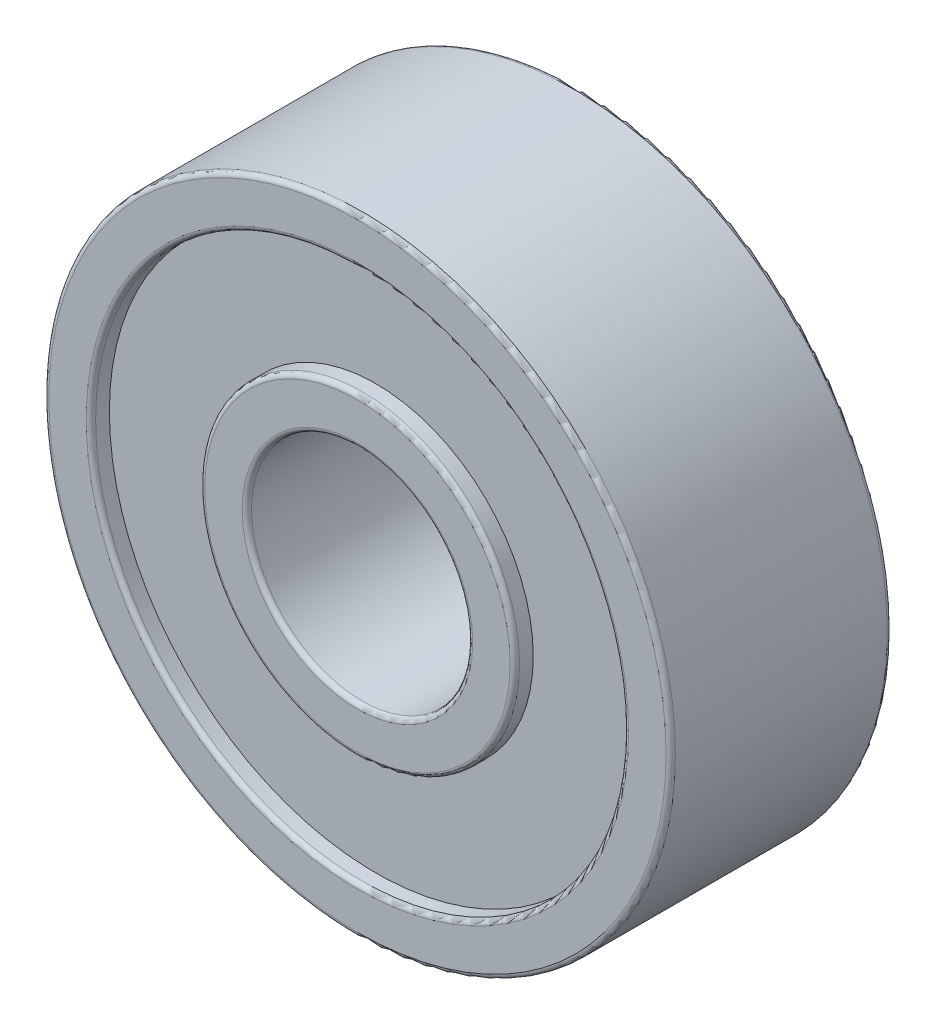
ISO-10303-21;
HEADER;
FILE_DESCRIPTION(('STEP AP214'),'2;1');
FILE_NAME('part.step','',(''),(''),'','','');
FILE_SCHEMA(('AUTOMOTIVE_DESIGN { 1 0 10303 214 1 1 1 1 }'));
ENDSEC;
DATA;
#1=APPLICATION_CONTEXT('core data for automotive mechanical design processes');
#2=APPLICATION_PROTOCOL_DEFINITION('international standard','automotive_design',2000,#1);
#3=PRODUCT_CONTEXT('',#1,'mechanical');
#4=PRODUCT('Part','Part','',(#3));
#5=PRODUCT_RELATED_PRODUCT_CATEGORY('part','',(#4));
#6=PRODUCT_DEFINITION_FORMATION('','',#4);
#7=PRODUCT_DEFINITION_CONTEXT('part definition',#1,'design');
#8=PRODUCT_DEFINITION('design','',#6,#7);
#9=PRODUCT_DEFINITION_SHAPE('','',#8);
#10=(LENGTH_UNIT() NAMED_UNIT(*) SI_UNIT(.MILLI.,.METRE.));
#11=(NAMED_UNIT(*) PLANE_ANGLE_UNIT() SI_UNIT($,.RADIAN.));
#12=(NAMED_UNIT(*) SI_UNIT($,.STERADIAN.) SOLID_ANGLE_UNIT());
#13=UNCERTAINTY_MEASURE_WITH_UNIT(LENGTH_MEASURE(1.E-05),#10,'distance_accuracy_value','');
#14=(GEOMETRIC_REPRESENTATION_CONTEXT(3) GLOBAL_UNCERTAINTY_ASSIGNED_CONTEXT((#13)) GLOBAL_UNIT_ASSIGNED_CONTEXT((#10,
#11,#12)) REPRESENTATION_CONTEXT('',''));
#15=CARTESIAN_POINT('',(0.,0.,0.));
#16=DIRECTION('',(0.,0.,1.));
#17=DIRECTION('',(1.,0.,0.));
#18=AXIS2_PLACEMENT_3D('',#15,#16,#17);
#19=CARTESIAN_POINT('',(0.,0.,2.5));
#20=DIRECTION('',(0.,0.,1.));
#21=DIRECTION('',(1.,0.,0.));
#22=AXIS2_PLACEMENT_3D('',#19,#20,#21);
#23=PLANE('',#22);
#24=CARTESIAN_POINT('',(0.,0.,2.5));
#25=DIRECTION('',(0.,0.,1.));
#26=DIRECTION('',(1.,0.,0.));
#27=AXIS2_PLACEMENT_3D('',#24,#25,#26);
#28=CIRCLE('',#27,7.23);
#29=CARTESIAN_POINT('',(7.23,0.,2.5));
#30=VERTEX_POINT('',#29);
#31=EDGE_CURVE('E11',#30,#30,#28,.T.);
#32=ORIENTED_EDGE('',*,*,#31,.T.);
#33=EDGE_LOOP('',(#32));
#34=FACE_BOUND('',#33,.T.);
#35=CARTESIAN_POINT('',(0.,0.,2.5));
#36=DIRECTION('',(0.,0.,1.));
#37=DIRECTION('',(1.,0.,0.));
#38=AXIS2_PLACEMENT_3D('',#35,#36,#37);
#39=CIRCLE('',#38,4.27);
#40=CARTESIAN_POINT('',(4.27,0.,2.5));
#41=VERTEX_POINT('',#40);
#42=EDGE_CURVE('E50',#41,#41,#39,.T.);
#43=ORIENTED_EDGE('',*,*,#42,.F.);
#44=EDGE_LOOP('',(#43));
#45=FACE_BOUND('',#44,.T.);
#46=ADVANCED_FACE('F39',(#34,#45),#23,.T.);
#47=CARTESIAN_POINT('',(0.,0.,-2.5));
#48=DIRECTION('',(0.,0.,1.));
#49=DIRECTION('',(1.,0.,0.));
#50=AXIS2_PLACEMENT_3D('',#47,#48,#49);
#51=PLANE('',#50);
#52=CARTESIAN_POINT('',(0.,0.,-2.5));
#53=DIRECTION('',(0.,0.,1.));
#54=DIRECTION('',(1.,0.,0.));
#55=AXIS2_PLACEMENT_3D('',#52,#53,#54);
#56=CIRCLE('',#55,7.23);
#57=CARTESIAN_POINT('',(7.23,0.,-2.5));
#58=VERTEX_POINT('',#57);
#59=EDGE_CURVE('E43',#58,#58,#56,.T.);
#60=ORIENTED_EDGE('',*,*,#59,.F.);
#61=EDGE_LOOP('',(#60));
#62=FACE_BOUND('',#61,.T.);
#63=CARTESIAN_POINT('',(0.,0.,-2.5));
#64=DIRECTION('',(0.,0.,1.));
#65=DIRECTION('',(1.,0.,0.));
#66=AXIS2_PLACEMENT_3D('',#63,#64,#65);
#67=CIRCLE('',#66,4.27);
#68=CARTESIAN_POINT('',(4.27,0.,-2.5));
#69=VERTEX_POINT('',#68);
#70=EDGE_CURVE('E52',#69,#69,#67,.T.);
#71=ORIENTED_EDGE('',*,*,#70,.T.);
#72=EDGE_LOOP('',(#71));
#73=FACE_BOUND('',#72,.T.);
#74=ADVANCED_FACE('F62',(#62,#73),#51,.F.);
#75=CARTESIAN_POINT('',(0.,0.,2.5));
#76=DIRECTION('',(0.,0.,-1.));
#77=DIRECTION('',(-1.,0.,0.));
#78=AXIS2_PLACEMENT_3D('',#75,#76,#77);
#79=CYLINDRICAL_SURFACE('',#78,7.23);
#80=ORIENTED_EDGE('',*,*,#31,.F.);
#81=EDGE_LOOP('',(#80));
#82=FACE_BOUND('',#81,.T.);
#83=ORIENTED_EDGE('',*,*,#59,.T.);
#84=EDGE_LOOP('',(#83));
#85=FACE_BOUND('',#84,.T.);
#86=ADVANCED_FACE('F41',(#82,#85),#79,.T.);
#87=CARTESIAN_POINT('',(0.,0.,2.5));
#88=DIRECTION('',(0.,0.,-1.));
#89=DIRECTION('',(-1.,0.,0.));
#90=AXIS2_PLACEMENT_3D('',#87,#88,#89);
#91=CYLINDRICAL_SURFACE('',#90,4.27);
#92=ORIENTED_EDGE('',*,*,#42,.T.);
#93=EDGE_LOOP('',(#92));
#94=FACE_BOUND('',#93,.T.);
#95=ORIENTED_EDGE('',*,*,#70,.F.);
#96=EDGE_LOOP('',(#95));
#97=FACE_BOUND('',#96,.T.);
#98=ADVANCED_FACE('F58',(#94,#97),#91,.F.);
#99=CLOSED_SHELL('',(#46,#74,#86,#98));
#100=MANIFOLD_SOLID_BREP('B2',#99);
#101=CARTESIAN_POINT('',(0.,0.,3.));
#102=DIRECTION('',(0.,0.,1.));
#103=DIRECTION('',(1.,0.,0.));
#104=AXIS2_PLACEMENT_3D('',#101,#102,#103);
#105=PLANE('',#104);
#106=CARTESIAN_POINT('',(0.,0.,3.));
#107=DIRECTION('',(0.,0.,1.));
#108=DIRECTION('',(1.,0.,0.));
#109=AXIS2_PLACEMENT_3D('',#106,#107,#108);
#110=CIRCLE('',#109,7.357);
#111=CARTESIAN_POINT('',(7.357,0.,3.));
#112=VERTEX_POINT('',#111);
#113=EDGE_CURVE('E38',#112,#112,#110,.F.);
#114=ORIENTED_EDGE('',*,*,#113,.T.);
#115=EDGE_LOOP('',(#114));
#116=FACE_BOUND('',#115,.T.);
#117=CARTESIAN_POINT('',(0.,0.,3.));
#118=DIRECTION('',(0.,0.,1.));
#119=DIRECTION('',(1.,0.,0.));
#120=AXIS2_PLACEMENT_3D('',#117,#118,#119);
#121=CIRCLE('',#120,8.373);
#122=CARTESIAN_POINT('',(8.373,0.,3.));
#123=VERTEX_POINT('',#122);
#124=EDGE_CURVE('E114',#123,#123,#121,.T.);
#125=ORIENTED_EDGE('',*,*,#124,.T.);
#126=EDGE_LOOP('',(#125));
#127=FACE_BOUND('',#126,.T.);
#128=ADVANCED_FACE('F107',(#116,#127),#105,.T.);
#129=CARTESIAN_POINT('',(0.,0.,-3.));
#130=DIRECTION('',(0.,0.,1.));
#131=DIRECTION('',(1.,0.,0.));
#132=AXIS2_PLACEMENT_3D('',#129,#130,#131);
#133=PLANE('',#132);
#134=CARTESIAN_POINT('',(0.,0.,-3.));
#135=DIRECTION('',(0.,0.,1.));
#136=DIRECTION('',(1.,0.,0.));
#137=AXIS2_PLACEMENT_3D('',#134,#135,#136);
#138=CIRCLE('',#137,7.357);
#139=CARTESIAN_POINT('',(7.357,0.,-3.));
#140=VERTEX_POINT('',#139);
#141=EDGE_CURVE('E133',#140,#140,#138,.T.);
#142=ORIENTED_EDGE('',*,*,#141,.T.);
#143=EDGE_LOOP('',(#142));
#144=FACE_BOUND('',#143,.T.);
#145=CARTESIAN_POINT('',(0.,0.,-3.));
#146=DIRECTION('',(0.,0.,1.));
#147=DIRECTION('',(1.,0.,0.));
#148=AXIS2_PLACEMENT_3D('',#145,#146,#147);
#149=CIRCLE('',#148,8.373);
#150=CARTESIAN_POINT('',(8.373,0.,-3.));
#151=VERTEX_POINT('',#150);
#152=EDGE_CURVE('E136',#151,#151,#149,.F.);
#153=ORIENTED_EDGE('',*,*,#152,.T.);
#154=EDGE_LOOP('',(#153));
#155=FACE_BOUND('',#154,.T.);
#156=ADVANCED_FACE('F140',(#144,#155),#133,.F.);
#157=CARTESIAN_POINT('',(0.,0.,3.));
#158=DIRECTION('',(0.,0.,-1.));
#159=DIRECTION('',(-1.,0.,0.));
#160=AXIS2_PLACEMENT_3D('',#157,#158,#159);
#161=CYLINDRICAL_SURFACE('',#160,8.5);
#162=CARTESIAN_POINT('',(0.,0.,-2.873));
#163=DIRECTION('',(0.,0.,1.));
#164=DIRECTION('',(1.,0.,0.));
#165=AXIS2_PLACEMENT_3D('',#162,#163,#164);
#166=CIRCLE('',#165,8.5);
#167=CARTESIAN_POINT('',(8.5,0.,-2.873));
#168=VERTEX_POINT('',#167);
#169=EDGE_CURVE('E118',#168,#168,#166,.T.);
#170=ORIENTED_EDGE('',*,*,#169,.T.);
#171=EDGE_LOOP('',(#170));
#172=FACE_BOUND('',#171,.T.);
#173=CARTESIAN_POINT('',(0.,0.,2.873));
#174=DIRECTION('',(0.,0.,1.));
#175=DIRECTION('',(1.,0.,0.));
#176=AXIS2_PLACEMENT_3D('',#173,#174,#175);
#177=CIRCLE('',#176,8.5);
#178=CARTESIAN_POINT('',(8.5,0.,2.873));
#179=VERTEX_POINT('',#178);
#180=EDGE_CURVE('E122',#179,#179,#177,.F.);
#181=ORIENTED_EDGE('',*,*,#180,.T.);
#182=EDGE_LOOP('',(#181));
#183=FACE_BOUND('',#182,.T.);
#184=ADVANCED_FACE('F150',(#172,#183),#161,.T.);
#185=CARTESIAN_POINT('',(0.,0.,3.));
#186=DIRECTION('',(0.,0.,-1.));
#187=DIRECTION('',(-1.,0.,0.));
#188=AXIS2_PLACEMENT_3D('',#185,#186,#187);
#189=CYLINDRICAL_SURFACE('',#188,7.23);
#190=CARTESIAN_POINT('',(0.,0.,-2.873));
#191=DIRECTION('',(0.,0.,1.));
#192=DIRECTION('',(1.,0.,0.));
#193=AXIS2_PLACEMENT_3D('',#190,#191,#192);
#194=CIRCLE('',#193,7.23);
#195=CARTESIAN_POINT('',(7.23,0.,-2.873));
#196=VERTEX_POINT('',#195);
#197=EDGE_CURVE('E127',#196,#196,#194,.F.);
#198=ORIENTED_EDGE('',*,*,#197,.T.);
#199=EDGE_LOOP('',(#198));
#200=FACE_BOUND('',#199,.T.);
#201=CARTESIAN_POINT('',(0.,0.,2.873));
#202=DIRECTION('',(0.,0.,1.));
#203=DIRECTION('',(1.,0.,0.));
#204=AXIS2_PLACEMENT_3D('',#201,#202,#203);
#205=CIRCLE('',#204,7.23);
#206=CARTESIAN_POINT('',(7.23,0.,2.873));
#207=VERTEX_POINT('',#206);
#208=EDGE_CURVE('E130',#207,#207,#205,.T.);
#209=ORIENTED_EDGE('',*,*,#208,.T.);
#210=EDGE_LOOP('',(#209));
#211=FACE_BOUND('',#210,.T.);
#212=ADVANCED_FACE('F153',(#200,#211),#189,.F.);
#213=CARTESIAN_POINT('',(0.,0.,-2.873));
#214=DIRECTION('',(0.,0.,1.));
#215=DIRECTION('',(1.,0.,0.));
#216=AXIS2_PLACEMENT_3D('',#213,#214,#215);
#217=TOROIDAL_SURFACE('',#216,7.357,0.127);
#218=ORIENTED_EDGE('',*,*,#197,.F.);
#219=EDGE_LOOP('',(#218));
#220=FACE_BOUND('',#219,.T.);
#221=ORIENTED_EDGE('',*,*,#141,.F.);
#222=EDGE_LOOP('',(#221));
#223=FACE_BOUND('',#222,.T.);
#224=ADVANCED_FACE('F146',(#220,#223),#217,.T.);
#225=CARTESIAN_POINT('',(0.,0.,-2.873));
#226=DIRECTION('',(0.,0.,1.));
#227=DIRECTION('',(1.,0.,0.));
#228=AXIS2_PLACEMENT_3D('',#225,#226,#227);
#229=TOROIDAL_SURFACE('',#228,8.373,0.127);
#230=ORIENTED_EDGE('',*,*,#152,.F.);
#231=EDGE_LOOP('',(#230));
#232=FACE_BOUND('',#231,.T.);
#233=ORIENTED_EDGE('',*,*,#169,.F.);
#234=EDGE_LOOP('',(#233));
#235=FACE_BOUND('',#234,.T.);
#236=ADVANCED_FACE('F142',(#232,#235),#229,.T.);
#237=CARTESIAN_POINT('',(0.,0.,2.873));
#238=DIRECTION('',(0.,0.,1.));
#239=DIRECTION('',(1.,0.,0.));
#240=AXIS2_PLACEMENT_3D('',#237,#238,#239);
#241=TOROIDAL_SURFACE('',#240,7.357,0.127);
#242=ORIENTED_EDGE('',*,*,#113,.F.);
#243=EDGE_LOOP('',(#242));
#244=FACE_BOUND('',#243,.T.);
#245=ORIENTED_EDGE('',*,*,#208,.F.);
#246=EDGE_LOOP('',(#245));
#247=FACE_BOUND('',#246,.T.);
#248=ADVANCED_FACE('F145',(#244,#247),#241,.T.);
#249=CARTESIAN_POINT('',(0.,0.,2.873));
#250=DIRECTION('',(0.,0.,1.));
#251=DIRECTION('',(1.,0.,0.));
#252=AXIS2_PLACEMENT_3D('',#249,#250,#251);
#253=TOROIDAL_SURFACE('',#252,8.373,0.127);
#254=ORIENTED_EDGE('',*,*,#180,.F.);
#255=EDGE_LOOP('',(#254));
#256=FACE_BOUND('',#255,.T.);
#257=ORIENTED_EDGE('',*,*,#124,.F.);
#258=EDGE_LOOP('',(#257));
#259=FACE_BOUND('',#258,.T.);
#260=ADVANCED_FACE('F109',(#256,#259),#253,.T.);
#261=CLOSED_SHELL('',(#128,#156,#184,#212,#224,#236,#248,#260));
#262=MANIFOLD_SOLID_BREP('B6',#261);
#263=CARTESIAN_POINT('',(0.,0.,3.));
#264=DIRECTION('',(0.,0.,1.));
#265=DIRECTION('',(1.,0.,0.));
#266=AXIS2_PLACEMENT_3D('',#263,#264,#265);
#267=PLANE('',#266);
#268=CARTESIAN_POINT('',(0.,0.,3.));
#269=DIRECTION('',(0.,0.,1.));
#270=DIRECTION('',(1.,0.,0.));
#271=AXIS2_PLACEMENT_3D('',#268,#269,#270);
#272=CIRCLE('',#271,3.127);
#273=CARTESIAN_POINT('',(3.127,0.,3.));
#274=VERTEX_POINT('',#273);
#275=EDGE_CURVE('E106',#274,#274,#272,.F.);
#276=ORIENTED_EDGE('',*,*,#275,.T.);
#277=EDGE_LOOP('',(#276));
#278=FACE_BOUND('',#277,.T.);
#279=CARTESIAN_POINT('',(0.,0.,3.));
#280=DIRECTION('',(0.,0.,1.));
#281=DIRECTION('',(1.,0.,0.));
#282=AXIS2_PLACEMENT_3D('',#279,#280,#281);
#283=CIRCLE('',#282,4.143);
#284=CARTESIAN_POINT('',(4.143,0.,3.));
#285=VERTEX_POINT('',#284);
#286=EDGE_CURVE('E235',#285,#285,#283,.T.);
#287=ORIENTED_EDGE('',*,*,#286,.T.);
#288=EDGE_LOOP('',(#287));
#289=FACE_BOUND('',#288,.T.);
#290=ADVANCED_FACE('F228',(#278,#289),#267,.T.);
#291=CARTESIAN_POINT('',(0.,0.,-3.));
#292=DIRECTION('',(0.,0.,1.));
#293=DIRECTION('',(1.,0.,0.));
#294=AXIS2_PLACEMENT_3D('',#291,#292,#293);
#295=PLANE('',#294);
#296=CARTESIAN_POINT('',(0.,0.,-3.));
#297=DIRECTION('',(0.,0.,1.));
#298=DIRECTION('',(1.,0.,0.));
#299=AXIS2_PLACEMENT_3D('',#296,#297,#298);
#300=CIRCLE('',#299,3.127);
#301=CARTESIAN_POINT('',(3.127,0.,-3.));
#302=VERTEX_POINT('',#301);
#303=EDGE_CURVE('E254',#302,#302,#300,.T.);
#304=ORIENTED_EDGE('',*,*,#303,.T.);
#305=EDGE_LOOP('',(#304));
#306=FACE_BOUND('',#305,.T.);
#307=CARTESIAN_POINT('',(0.,0.,-3.));
#308=DIRECTION('',(0.,0.,1.));
#309=DIRECTION('',(1.,0.,0.));
#310=AXIS2_PLACEMENT_3D('',#307,#308,#309);
#311=CIRCLE('',#310,4.143);
#312=CARTESIAN_POINT('',(4.143,0.,-3.));
#313=VERTEX_POINT('',#312);
#314=EDGE_CURVE('E257',#313,#313,#311,.F.);
#315=ORIENTED_EDGE('',*,*,#314,.T.);
#316=EDGE_LOOP('',(#315));
#317=FACE_BOUND('',#316,.T.);
#318=ADVANCED_FACE('F261',(#306,#317),#295,.F.);
#319=CARTESIAN_POINT('',(0.,0.,3.));
#320=DIRECTION('',(0.,0.,-1.));
#321=DIRECTION('',(-1.,0.,0.));
#322=AXIS2_PLACEMENT_3D('',#319,#320,#321);
#323=CYLINDRICAL_SURFACE('',#322,4.27);
#324=CARTESIAN_POINT('',(0.,0.,-2.873));
#325=DIRECTION('',(0.,0.,1.));
#326=DIRECTION('',(1.,0.,0.));
#327=AXIS2_PLACEMENT_3D('',#324,#325,#326);
#328=CIRCLE('',#327,4.27);
#329=CARTESIAN_POINT('',(4.27,0.,-2.873));
#330=VERTEX_POINT('',#329);
#331=EDGE_CURVE('E239',#330,#330,#328,.T.);
#332=ORIENTED_EDGE('',*,*,#331,.T.);
#333=EDGE_LOOP('',(#332));
#334=FACE_BOUND('',#333,.T.);
#335=CARTESIAN_POINT('',(0.,0.,2.873));
#336=DIRECTION('',(0.,0.,1.));
#337=DIRECTION('',(1.,0.,0.));
#338=AXIS2_PLACEMENT_3D('',#335,#336,#337);
#339=CIRCLE('',#338,4.27);
#340=CARTESIAN_POINT('',(4.27,0.,2.873));
#341=VERTEX_POINT('',#340);
#342=EDGE_CURVE('E243',#341,#341,#339,.F.);
#343=ORIENTED_EDGE('',*,*,#342,.T.);
#344=EDGE_LOOP('',(#343));
#345=FACE_BOUND('',#344,.T.);
#346=ADVANCED_FACE('F271',(#334,#345),#323,.T.);
#347=CARTESIAN_POINT('',(0.,0.,3.));
#348=DIRECTION('',(0.,0.,-1.));
#349=DIRECTION('',(-1.,0.,0.));
#350=AXIS2_PLACEMENT_3D('',#347,#348,#349);
#351=CYLINDRICAL_SURFACE('',#350,3.);
#352=CARTESIAN_POINT('',(0.,0.,-2.873));
#353=DIRECTION('',(0.,0.,1.));
#354=DIRECTION('',(1.,0.,0.));
#355=AXIS2_PLACEMENT_3D('',#352,#353,#354);
#356=CIRCLE('',#355,3.);
#357=CARTESIAN_POINT('',(3.,0.,-2.873));
#358=VERTEX_POINT('',#357);
#359=EDGE_CURVE('E248',#358,#358,#356,.F.);
#360=ORIENTED_EDGE('',*,*,#359,.T.);
#361=EDGE_LOOP('',(#360));
#362=FACE_BOUND('',#361,.T.);
#363=CARTESIAN_POINT('',(0.,0.,2.873));
#364=DIRECTION('',(0.,0.,1.));
#365=DIRECTION('',(1.,0.,0.));
#366=AXIS2_PLACEMENT_3D('',#363,#364,#365);
#367=CIRCLE('',#366,3.);
#368=CARTESIAN_POINT('',(3.,0.,2.873));
#369=VERTEX_POINT('',#368);
#370=EDGE_CURVE('E251',#369,#369,#367,.T.);
#371=ORIENTED_EDGE('',*,*,#370,.T.);
#372=EDGE_LOOP('',(#371));
#373=FACE_BOUND('',#372,.T.);
#374=ADVANCED_FACE('F274',(#362,#373),#351,.F.);
#375=CARTESIAN_POINT('',(0.,0.,-2.873));
#376=DIRECTION('',(0.,0.,1.));
#377=DIRECTION('',(1.,0.,0.));
#378=AXIS2_PLACEMENT_3D('',#375,#376,#377);
#379=TOROIDAL_SURFACE('',#378,3.127,0.127);
#380=ORIENTED_EDGE('',*,*,#359,.F.);
#381=EDGE_LOOP('',(#380));
#382=FACE_BOUND('',#381,.T.);
#383=ORIENTED_EDGE('',*,*,#303,.F.);
#384=EDGE_LOOP('',(#383));
#385=FACE_BOUND('',#384,.T.);
#386=ADVANCED_FACE('F267',(#382,#385),#379,.T.);
#387=CARTESIAN_POINT('',(0.,0.,-2.873));
#388=DIRECTION('',(0.,0.,1.));
#389=DIRECTION('',(1.,0.,0.));
#390=AXIS2_PLACEMENT_3D('',#387,#388,#389);
#391=TOROIDAL_SURFACE('',#390,4.143,0.127);
#392=ORIENTED_EDGE('',*,*,#314,.F.);
#393=EDGE_LOOP('',(#392));
#394=FACE_BOUND('',#393,.T.);
#395=ORIENTED_EDGE('',*,*,#331,.F.);
#396=EDGE_LOOP('',(#395));
#397=FACE_BOUND('',#396,.T.);
#398=ADVANCED_FACE('F263',(#394,#397),#391,.T.);
#399=CARTESIAN_POINT('',(0.,0.,2.873));
#400=DIRECTION('',(0.,0.,1.));
#401=DIRECTION('',(1.,0.,0.));
#402=AXIS2_PLACEMENT_3D('',#399,#400,#401);
#403=TOROIDAL_SURFACE('',#402,3.127,0.127);
#404=ORIENTED_EDGE('',*,*,#275,.F.);
#405=EDGE_LOOP('',(#404));
#406=FACE_BOUND('',#405,.T.);
#407=ORIENTED_EDGE('',*,*,#370,.F.);
#408=EDGE_LOOP('',(#407));
#409=FACE_BOUND('',#408,.T.);
#410=ADVANCED_FACE('F266',(#406,#409),#403,.T.);
#411=CARTESIAN_POINT('',(0.,0.,2.873));
#412=DIRECTION('',(0.,0.,1.));
#413=DIRECTION('',(1.,0.,0.));
#414=AXIS2_PLACEMENT_3D('',#411,#412,#413);
#415=TOROIDAL_SURFACE('',#414,4.143,0.127);
#416=ORIENTED_EDGE('',*,*,#342,.F.);
#417=EDGE_LOOP('',(#416));
#418=FACE_BOUND('',#417,.T.);
#419=ORIENTED_EDGE('',*,*,#286,.F.);
#420=EDGE_LOOP('',(#419));
#421=FACE_BOUND('',#420,.T.);
#422=ADVANCED_FACE('F230',(#418,#421),#415,.T.);
#423=CLOSED_SHELL('',(#290,#318,#346,#374,#386,#398,#410,#422));
#424=MANIFOLD_SOLID_BREP('B33',#423);
#425=ADVANCED_BREP_SHAPE_REPRESENTATION('',(#18,#100,#262,#424),#14);
#426=SHAPE_DEFINITION_REPRESENTATION(#9,#425);
ENDSEC;
END-ISO-10303-21;
